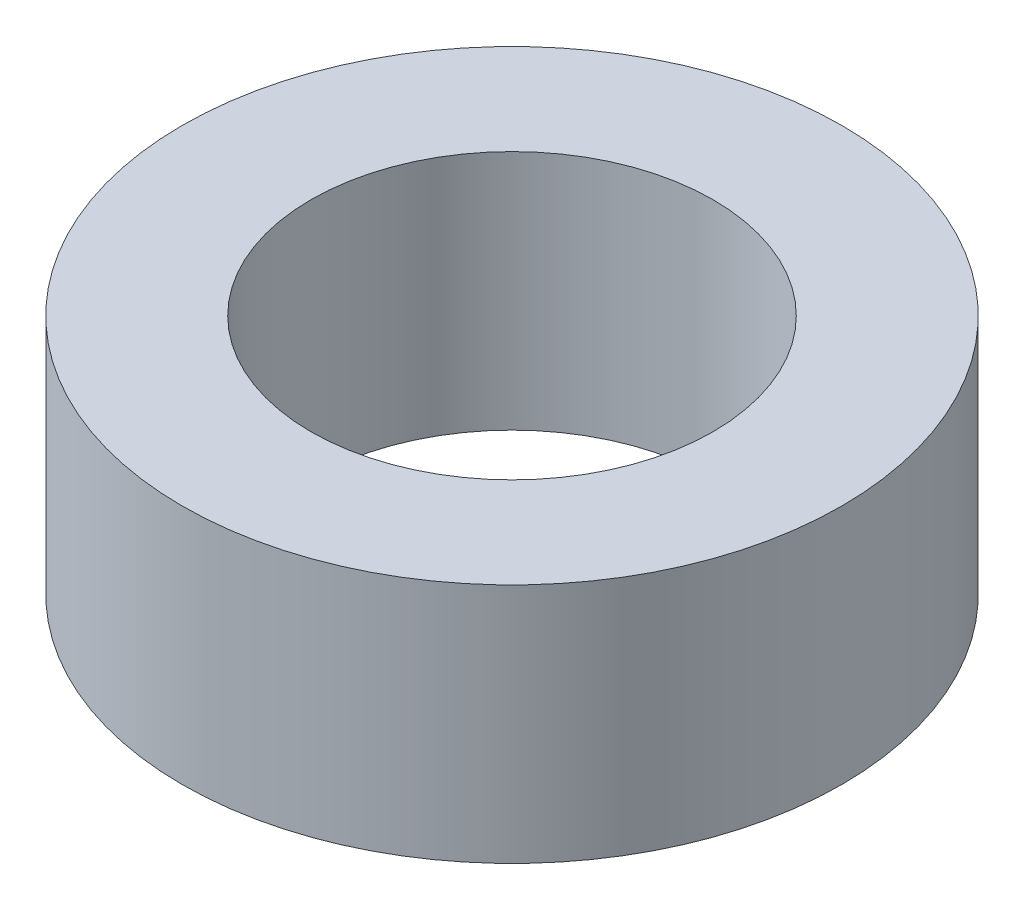
ISO-10303-21;
HEADER;
FILE_DESCRIPTION(('STEP AP214'),'2;1');
FILE_NAME('part.step','',(''),(''),'','','');
FILE_SCHEMA(('AUTOMOTIVE_DESIGN { 1 0 10303 214 1 1 1 1 }'));
ENDSEC;
DATA;
#1=APPLICATION_CONTEXT('core data for automotive mechanical design processes');
#2=APPLICATION_PROTOCOL_DEFINITION('international standard','automotive_design',2000,#1);
#3=PRODUCT_CONTEXT('',#1,'mechanical');
#4=PRODUCT('Part','Part','',(#3));
#5=PRODUCT_RELATED_PRODUCT_CATEGORY('part','',(#4));
#6=PRODUCT_DEFINITION_FORMATION('','',#4);
#7=PRODUCT_DEFINITION_CONTEXT('part definition',#1,'design');
#8=PRODUCT_DEFINITION('design','',#6,#7);
#9=PRODUCT_DEFINITION_SHAPE('','',#8);
#10=(LENGTH_UNIT() NAMED_UNIT(*) SI_UNIT(.MILLI.,.METRE.));
#11=(NAMED_UNIT(*) PLANE_ANGLE_UNIT() SI_UNIT($,.RADIAN.));
#12=(NAMED_UNIT(*) SI_UNIT($,.STERADIAN.) SOLID_ANGLE_UNIT());
#13=UNCERTAINTY_MEASURE_WITH_UNIT(LENGTH_MEASURE(1.E-05),#10,'distance_accuracy_value','');
#14=(GEOMETRIC_REPRESENTATION_CONTEXT(3) GLOBAL_UNCERTAINTY_ASSIGNED_CONTEXT((#13)) GLOBAL_UNIT_ASSIGNED_CONTEXT((#10,
#11,#12)) REPRESENTATION_CONTEXT('',''));
#15=CARTESIAN_POINT('',(0.,0.,0.));
#16=DIRECTION('',(0.,0.,1.));
#17=DIRECTION('',(1.,0.,0.));
#18=AXIS2_PLACEMENT_3D('',#15,#16,#17);
#19=CARTESIAN_POINT('',(0.,15.,0.));
#20=DIRECTION('',(0.,1.,0.));
#21=DIRECTION('',(0.,0.,1.));
#22=AXIS2_PLACEMENT_3D('',#19,#20,#21);
#23=PLANE('',#22);
#24=CARTESIAN_POINT('',(0.,15.,0.));
#25=DIRECTION('',(0.,1.,0.));
#26=DIRECTION('',(0.,0.,1.));
#27=AXIS2_PLACEMENT_3D('',#24,#25,#26);
#28=CIRCLE('',#27,20.5);
#29=CARTESIAN_POINT('',(0.,15.,20.5));
#30=VERTEX_POINT('',#29);
#31=EDGE_CURVE('E10',#30,#30,#28,.T.);
#32=ORIENTED_EDGE('',*,*,#31,.T.);
#33=EDGE_LOOP('',(#32));
#34=FACE_BOUND('',#33,.T.);
#35=CARTESIAN_POINT('',(0.,15.,0.));
#36=DIRECTION('',(0.,1.,0.));
#37=DIRECTION('',(0.,0.,1.));
#38=AXIS2_PLACEMENT_3D('',#35,#36,#37);
#39=CIRCLE('',#38,12.5);
#40=CARTESIAN_POINT('',(0.,15.,12.5));
#41=VERTEX_POINT('',#40);
#42=EDGE_CURVE('E50',#41,#41,#39,.T.);
#43=ORIENTED_EDGE('',*,*,#42,.F.);
#44=EDGE_LOOP('',(#43));
#45=FACE_BOUND('',#44,.T.);
#46=ADVANCED_FACE('F37',(#34,#45),#23,.T.);
#47=CARTESIAN_POINT('',(0.,0.,0.));
#48=DIRECTION('',(0.,1.,0.));
#49=DIRECTION('',(0.,0.,1.));
#50=AXIS2_PLACEMENT_3D('',#47,#48,#49);
#51=PLANE('',#50);
#52=CARTESIAN_POINT('',(0.,0.,0.));
#53=DIRECTION('',(0.,1.,0.));
#54=DIRECTION('',(0.,0.,1.));
#55=AXIS2_PLACEMENT_3D('',#52,#53,#54);
#56=CIRCLE('',#55,20.5);
#57=CARTESIAN_POINT('',(0.,0.,20.5));
#58=VERTEX_POINT('',#57);
#59=EDGE_CURVE('E41',#58,#58,#56,.T.);
#60=ORIENTED_EDGE('',*,*,#59,.F.);
#61=EDGE_LOOP('',(#60));
#62=FACE_BOUND('',#61,.T.);
#63=CARTESIAN_POINT('',(0.,0.,0.));
#64=DIRECTION('',(0.,1.,0.));
#65=DIRECTION('',(0.,0.,1.));
#66=AXIS2_PLACEMENT_3D('',#63,#64,#65);
#67=CIRCLE('',#66,12.5);
#68=CARTESIAN_POINT('',(0.,0.,12.5));
#69=VERTEX_POINT('',#68);
#70=EDGE_CURVE('E52',#69,#69,#67,.T.);
#71=ORIENTED_EDGE('',*,*,#70,.T.);
#72=EDGE_LOOP('',(#71));
#73=FACE_BOUND('',#72,.T.);
#74=ADVANCED_FACE('F64',(#62,#73),#51,.F.);
#75=CARTESIAN_POINT('',(0.,15.,0.));
#76=DIRECTION('',(0.,-1.,0.));
#77=DIRECTION('',(0.,0.,-1.));
#78=AXIS2_PLACEMENT_3D('',#75,#76,#77);
#79=CYLINDRICAL_SURFACE('',#78,20.5);
#80=ORIENTED_EDGE('',*,*,#31,.F.);
#81=EDGE_LOOP('',(#80));
#82=FACE_BOUND('',#81,.T.);
#83=ORIENTED_EDGE('',*,*,#59,.T.);
#84=EDGE_LOOP('',(#83));
#85=FACE_BOUND('',#84,.T.);
#86=ADVANCED_FACE('F39',(#82,#85),#79,.T.);
#87=CARTESIAN_POINT('',(0.,15.,0.));
#88=DIRECTION('',(0.,-1.,0.));
#89=DIRECTION('',(0.,0.,-1.));
#90=AXIS2_PLACEMENT_3D('',#87,#88,#89);
#91=CYLINDRICAL_SURFACE('',#90,12.5);
#92=ORIENTED_EDGE('',*,*,#42,.T.);
#93=EDGE_LOOP('',(#92));
#94=FACE_BOUND('',#93,.T.);
#95=ORIENTED_EDGE('',*,*,#70,.F.);
#96=EDGE_LOOP('',(#95));
#97=FACE_BOUND('',#96,.T.);
#98=ADVANCED_FACE('F60',(#94,#97),#91,.F.);
#99=CLOSED_SHELL('',(#46,#74,#86,#98));
#100=MANIFOLD_SOLID_BREP('B2',#99);
#101=ADVANCED_BREP_SHAPE_REPRESENTATION('',(#18,#100),#14);
#102=SHAPE_DEFINITION_REPRESENTATION(#9,#101);
ENDSEC;
END-ISO-10303-21;
